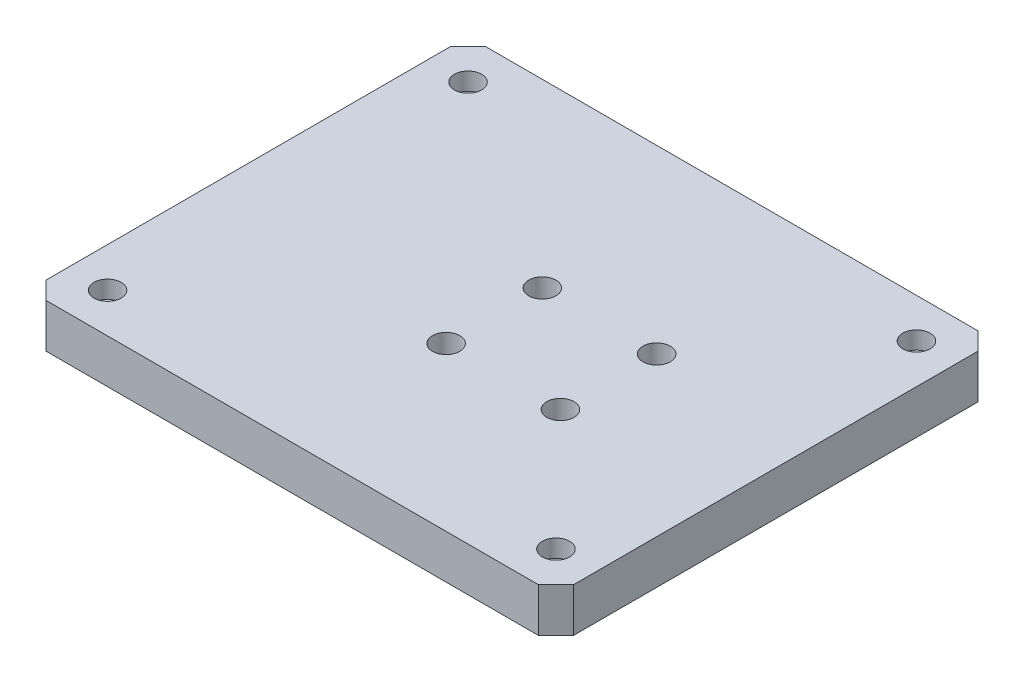
ISO-10303-21;
HEADER;
FILE_DESCRIPTION(('STEP AP214'),'2;1');
FILE_NAME('part.step','',(''),(''),'','','');
FILE_SCHEMA(('AUTOMOTIVE_DESIGN { 1 0 10303 214 1 1 1 1 }'));
ENDSEC;
DATA;
#1=APPLICATION_CONTEXT('core data for automotive mechanical design processes');
#2=APPLICATION_PROTOCOL_DEFINITION('international standard','automotive_design',2000,#1);
#3=PRODUCT_CONTEXT('',#1,'mechanical');
#4=PRODUCT('Part','Part','',(#3));
#5=PRODUCT_RELATED_PRODUCT_CATEGORY('part','',(#4));
#6=PRODUCT_DEFINITION_FORMATION('','',#4);
#7=PRODUCT_DEFINITION_CONTEXT('part definition',#1,'design');
#8=PRODUCT_DEFINITION('design','',#6,#7);
#9=PRODUCT_DEFINITION_SHAPE('','',#8);
#10=(LENGTH_UNIT() NAMED_UNIT(*) SI_UNIT(.MILLI.,.METRE.));
#11=(NAMED_UNIT(*) PLANE_ANGLE_UNIT() SI_UNIT($,.RADIAN.));
#12=(NAMED_UNIT(*) SI_UNIT($,.STERADIAN.) SOLID_ANGLE_UNIT());
#13=UNCERTAINTY_MEASURE_WITH_UNIT(LENGTH_MEASURE(1.E-05),#10,'distance_accuracy_value','');
#14=(GEOMETRIC_REPRESENTATION_CONTEXT(3) GLOBAL_UNCERTAINTY_ASSIGNED_CONTEXT((#13)) GLOBAL_UNIT_ASSIGNED_CONTEXT((#10,
#11,#12)) REPRESENTATION_CONTEXT('',''));
#15=CARTESIAN_POINT('',(0.,0.,0.));
#16=DIRECTION('',(0.,0.,1.));
#17=DIRECTION('',(1.,0.,0.));
#18=AXIS2_PLACEMENT_3D('',#15,#16,#17);
#19=CARTESIAN_POINT('',(0.,5.,0.));
#20=DIRECTION('',(1.,0.,0.));
#21=DIRECTION('',(0.,0.,-1.));
#22=AXIS2_PLACEMENT_3D('',#19,#20,#21);
#23=PLANE('',#22);
#24=DIRECTION('',(0.,0.,1.));
#25=VECTOR('',#24,1.);
#26=CARTESIAN_POINT('',(0.,0.,0.));
#27=LINE('',#26,#25);
#28=CARTESIAN_POINT('',(0.,0.,-48.));
#29=VERTEX_POINT('',#28);
#30=CARTESIAN_POINT('',(0.,0.,-2.00000000000002));
#31=VERTEX_POINT('',#30);
#32=EDGE_CURVE('E129',#29,#31,#27,.T.);
#33=ORIENTED_EDGE('',*,*,#32,.T.);
#34=DIRECTION('',(0.,1.,0.));
#35=VECTOR('',#34,1.);
#36=CARTESIAN_POINT('',(0.,5.,-2.00000000000002));
#37=LINE('',#36,#35);
#38=CARTESIAN_POINT('',(0.,5.,-2.00000000000002));
#39=VERTEX_POINT('',#38);
#40=EDGE_CURVE('E11',#31,#39,#37,.T.);
#41=ORIENTED_EDGE('',*,*,#40,.T.);
#42=DIRECTION('',(0.,0.,1.));
#43=VECTOR('',#42,1.);
#44=CARTESIAN_POINT('',(0.,5.,0.));
#45=LINE('',#44,#43);
#46=CARTESIAN_POINT('',(0.,5.,-48.));
#47=VERTEX_POINT('',#46);
#48=EDGE_CURVE('E127',#47,#39,#45,.T.);
#49=ORIENTED_EDGE('',*,*,#48,.F.);
#50=DIRECTION('',(0.,-1.,0.));
#51=VECTOR('',#50,1.);
#52=CARTESIAN_POINT('',(0.,5.,-48.));
#53=LINE('',#52,#51);
#54=EDGE_CURVE('E41',#47,#29,#53,.T.);
#55=ORIENTED_EDGE('',*,*,#54,.T.);
#56=EDGE_LOOP('',(#33,#41,#49,#55));
#57=FACE_BOUND('',#56,.T.);
#58=ADVANCED_FACE('F33',(#57),#23,.F.);
#59=CARTESIAN_POINT('',(0.,5.,0.));
#60=DIRECTION('',(0.,0.,-1.));
#61=DIRECTION('',(-1.,0.,0.));
#62=AXIS2_PLACEMENT_3D('',#59,#60,#61);
#63=PLANE('',#62);
#64=DIRECTION('',(1.,0.,0.));
#65=VECTOR('',#64,1.);
#66=CARTESIAN_POINT('',(0.,0.,0.));
#67=LINE('',#66,#65);
#68=CARTESIAN_POINT('',(2.00000000000001,0.,0.));
#69=VERTEX_POINT('',#68);
#70=CARTESIAN_POINT('',(58.,0.,0.));
#71=VERTEX_POINT('',#70);
#72=EDGE_CURVE('E125',#69,#71,#67,.T.);
#73=ORIENTED_EDGE('',*,*,#72,.T.);
#74=DIRECTION('',(0.,1.,0.));
#75=VECTOR('',#74,1.);
#76=CARTESIAN_POINT('',(58.,5.,0.));
#77=LINE('',#76,#75);
#78=CARTESIAN_POINT('',(58.,5.,0.));
#79=VERTEX_POINT('',#78);
#80=EDGE_CURVE('E104',#71,#79,#77,.T.);
#81=ORIENTED_EDGE('',*,*,#80,.T.);
#82=DIRECTION('',(1.,0.,0.));
#83=VECTOR('',#82,1.);
#84=CARTESIAN_POINT('',(0.,5.,0.));
#85=LINE('',#84,#83);
#86=CARTESIAN_POINT('',(2.00000000000001,5.,0.));
#87=VERTEX_POINT('',#86);
#88=EDGE_CURVE('E169',#87,#79,#85,.T.);
#89=ORIENTED_EDGE('',*,*,#88,.F.);
#90=DIRECTION('',(0.,-1.,0.));
#91=VECTOR('',#90,1.);
#92=CARTESIAN_POINT('',(2.00000000000001,5.,0.));
#93=LINE('',#92,#91);
#94=EDGE_CURVE('E109',#87,#69,#93,.T.);
#95=ORIENTED_EDGE('',*,*,#94,.T.);
#96=EDGE_LOOP('',(#73,#81,#89,#95));
#97=FACE_BOUND('',#96,.T.);
#98=ADVANCED_FACE('F242',(#97),#63,.F.);
#99=CARTESIAN_POINT('',(60.,5.,0.));
#100=DIRECTION('',(-1.,0.,0.));
#101=DIRECTION('',(0.,0.,1.));
#102=AXIS2_PLACEMENT_3D('',#99,#100,#101);
#103=PLANE('',#102);
#104=DIRECTION('',(0.,0.,-1.));
#105=VECTOR('',#104,1.);
#106=CARTESIAN_POINT('',(60.,5.,0.));
#107=LINE('',#106,#105);
#108=CARTESIAN_POINT('',(60.,5.,-2.00000000000001));
#109=VERTEX_POINT('',#108);
#110=CARTESIAN_POINT('',(60.,5.,-48.));
#111=VERTEX_POINT('',#110);
#112=EDGE_CURVE('E118',#109,#111,#107,.T.);
#113=ORIENTED_EDGE('',*,*,#112,.F.);
#114=DIRECTION('',(0.,-1.,0.));
#115=VECTOR('',#114,1.);
#116=CARTESIAN_POINT('',(60.,5.,-2.00000000000001));
#117=LINE('',#116,#115);
#118=CARTESIAN_POINT('',(60.,0.,-2.00000000000003));
#119=VERTEX_POINT('',#118);
#120=EDGE_CURVE('E103',#109,#119,#117,.T.);
#121=ORIENTED_EDGE('',*,*,#120,.T.);
#122=DIRECTION('',(0.,0.,-1.));
#123=VECTOR('',#122,1.);
#124=CARTESIAN_POINT('',(60.,0.,0.));
#125=LINE('',#124,#123);
#126=CARTESIAN_POINT('',(60.,0.,-48.));
#127=VERTEX_POINT('',#126);
#128=EDGE_CURVE('E116',#119,#127,#125,.T.);
#129=ORIENTED_EDGE('',*,*,#128,.T.);
#130=DIRECTION('',(0.,1.,0.));
#131=VECTOR('',#130,1.);
#132=CARTESIAN_POINT('',(60.,5.,-48.));
#133=LINE('',#132,#131);
#134=EDGE_CURVE('E120',#127,#111,#133,.T.);
#135=ORIENTED_EDGE('',*,*,#134,.T.);
#136=EDGE_LOOP('',(#113,#121,#129,#135));
#137=FACE_BOUND('',#136,.T.);
#138=ADVANCED_FACE('F115',(#137),#103,.F.);
#139=CARTESIAN_POINT('',(0.,5.,-50.));
#140=DIRECTION('',(0.,0.,1.));
#141=DIRECTION('',(1.,0.,0.));
#142=AXIS2_PLACEMENT_3D('',#139,#140,#141);
#143=PLANE('',#142);
#144=DIRECTION('',(-1.,0.,0.));
#145=VECTOR('',#144,1.);
#146=CARTESIAN_POINT('',(0.,5.,-50.));
#147=LINE('',#146,#145);
#148=CARTESIAN_POINT('',(58.,5.,-50.));
#149=VERTEX_POINT('',#148);
#150=CARTESIAN_POINT('',(2.00000000000002,5.,-50.));
#151=VERTEX_POINT('',#150);
#152=EDGE_CURVE('E133',#149,#151,#147,.T.);
#153=ORIENTED_EDGE('',*,*,#152,.F.);
#154=DIRECTION('',(0.,-1.,0.));
#155=VECTOR('',#154,1.);
#156=CARTESIAN_POINT('',(58.,5.,-50.));
#157=LINE('',#156,#155);
#158=CARTESIAN_POINT('',(58.,0.,-50.));
#159=VERTEX_POINT('',#158);
#160=EDGE_CURVE('E150',#149,#159,#157,.T.);
#161=ORIENTED_EDGE('',*,*,#160,.T.);
#162=DIRECTION('',(-1.,0.,0.));
#163=VECTOR('',#162,1.);
#164=CARTESIAN_POINT('',(0.,0.,-50.));
#165=LINE('',#164,#163);
#166=CARTESIAN_POINT('',(2.00000000000002,0.,-50.));
#167=VERTEX_POINT('',#166);
#168=EDGE_CURVE('E124',#159,#167,#165,.T.);
#169=ORIENTED_EDGE('',*,*,#168,.T.);
#170=DIRECTION('',(0.,1.,0.));
#171=VECTOR('',#170,1.);
#172=CARTESIAN_POINT('',(2.00000000000002,5.,-50.));
#173=LINE('',#172,#171);
#174=EDGE_CURVE('E48',#167,#151,#173,.T.);
#175=ORIENTED_EDGE('',*,*,#174,.T.);
#176=EDGE_LOOP('',(#153,#161,#169,#175));
#177=FACE_BOUND('',#176,.T.);
#178=ADVANCED_FACE('F223',(#177),#143,.F.);
#179=CARTESIAN_POINT('',(0.,5.,0.));
#180=DIRECTION('',(0.,-1.,0.));
#181=DIRECTION('',(0.,0.,-1.));
#182=AXIS2_PLACEMENT_3D('',#179,#180,#181);
#183=PLANE('',#182);
#184=CARTESIAN_POINT('',(29.,5.,-18.5090290205092));
#185=DIRECTION('',(0.,1.,0.));
#186=DIRECTION('',(0.,0.,1.));
#187=AXIS2_PLACEMENT_3D('',#184,#185,#186);
#188=CIRCLE('',#187,1.54999999999979);
#189=CARTESIAN_POINT('',(29.,5.,-16.9590290205094));
#190=VERTEX_POINT('',#189);
#191=EDGE_CURVE('E209',#190,#190,#188,.T.);
#192=ORIENTED_EDGE('',*,*,#191,.F.);
#193=EDGE_LOOP('',(#192));
#194=FACE_BOUND('',#193,.T.);
#195=CARTESIAN_POINT('',(42.,5.,-18.5090290205092));
#196=DIRECTION('',(0.,1.,0.));
#197=DIRECTION('',(0.,0.,1.));
#198=AXIS2_PLACEMENT_3D('',#195,#196,#197);
#199=CIRCLE('',#198,1.54999999999979);
#200=CARTESIAN_POINT('',(42.,5.,-16.9590290205094));
#201=VERTEX_POINT('',#200);
#202=EDGE_CURVE('E203',#201,#201,#199,.T.);
#203=ORIENTED_EDGE('',*,*,#202,.F.);
#204=EDGE_LOOP('',(#203));
#205=FACE_BOUND('',#204,.T.);
#206=CARTESIAN_POINT('',(29.,5.,-29.4460523784597));
#207=DIRECTION('',(0.,1.,0.));
#208=DIRECTION('',(0.,0.,1.));
#209=AXIS2_PLACEMENT_3D('',#206,#207,#208);
#210=CIRCLE('',#209,1.5499999999998);
#211=CARTESIAN_POINT('',(29.,5.,-27.8960523784599));
#212=VERTEX_POINT('',#211);
#213=EDGE_CURVE('E197',#212,#212,#210,.T.);
#214=ORIENTED_EDGE('',*,*,#213,.F.);
#215=EDGE_LOOP('',(#214));
#216=FACE_BOUND('',#215,.T.);
#217=CARTESIAN_POINT('',(42.,5.,-29.4460523784597));
#218=DIRECTION('',(0.,1.,0.));
#219=DIRECTION('',(0.,0.,1.));
#220=AXIS2_PLACEMENT_3D('',#217,#218,#219);
#221=CIRCLE('',#220,1.5499999999998);
#222=CARTESIAN_POINT('',(42.,5.,-27.8960523784599));
#223=VERTEX_POINT('',#222);
#224=EDGE_CURVE('E191',#223,#223,#221,.T.);
#225=ORIENTED_EDGE('',*,*,#224,.F.);
#226=EDGE_LOOP('',(#225));
#227=FACE_BOUND('',#226,.T.);
#228=CARTESIAN_POINT('',(55.5,5.,-45.5000000000095));
#229=DIRECTION('',(0.,1.,0.));
#230=DIRECTION('',(0.,0.,1.));
#231=AXIS2_PLACEMENT_3D('',#228,#229,#230);
#232=CIRCLE('',#231,1.54999999999724);
#233=CARTESIAN_POINT('',(55.5,5.,-43.9500000000123));
#234=VERTEX_POINT('',#233);
#235=EDGE_CURVE('E188',#234,#234,#232,.T.);
#236=ORIENTED_EDGE('',*,*,#235,.F.);
#237=EDGE_LOOP('',(#236));
#238=FACE_BOUND('',#237,.T.);
#239=CARTESIAN_POINT('',(4.50000000000003,5.,-45.5000000000095));
#240=DIRECTION('',(0.,1.,0.));
#241=DIRECTION('',(0.,0.,1.));
#242=AXIS2_PLACEMENT_3D('',#239,#240,#241);
#243=CIRCLE('',#242,1.54999999999724);
#244=CARTESIAN_POINT('',(4.50000000000003,5.,-43.9500000000123));
#245=VERTEX_POINT('',#244);
#246=EDGE_CURVE('E182',#245,#245,#243,.T.);
#247=ORIENTED_EDGE('',*,*,#246,.F.);
#248=EDGE_LOOP('',(#247));
#249=FACE_BOUND('',#248,.T.);
#250=CARTESIAN_POINT('',(4.50000000000002,5.,-4.5000000000095));
#251=DIRECTION('',(0.,1.,0.));
#252=DIRECTION('',(0.,0.,1.));
#253=AXIS2_PLACEMENT_3D('',#250,#251,#252);
#254=CIRCLE('',#253,1.54999999999725);
#255=CARTESIAN_POINT('',(4.50000000000002,5.,-2.95000000001225));
#256=VERTEX_POINT('',#255);
#257=EDGE_CURVE('E176',#256,#256,#254,.T.);
#258=ORIENTED_EDGE('',*,*,#257,.F.);
#259=EDGE_LOOP('',(#258));
#260=FACE_BOUND('',#259,.T.);
#261=CARTESIAN_POINT('',(55.5,5.,-4.50000000000949));
#262=DIRECTION('',(0.,1.,0.));
#263=DIRECTION('',(0.,0.,1.));
#264=AXIS2_PLACEMENT_3D('',#261,#262,#263);
#265=CIRCLE('',#264,1.54999999999725);
#266=CARTESIAN_POINT('',(55.5,5.,-2.95000000001224));
#267=VERTEX_POINT('',#266);
#268=EDGE_CURVE('E164',#267,#267,#265,.T.);
#269=ORIENTED_EDGE('',*,*,#268,.F.);
#270=EDGE_LOOP('',(#269));
#271=FACE_BOUND('',#270,.T.);
#272=ORIENTED_EDGE('',*,*,#88,.T.);
#273=DIRECTION('',(-0.707106781186549,0.,0.707106781186546));
#274=VECTOR('',#273,1.);
#275=CARTESIAN_POINT('',(60.,5.,-2.00000000000001));
#276=LINE('',#275,#274);
#277=EDGE_CURVE('E147',#79,#109,#276,.F.);
#278=ORIENTED_EDGE('',*,*,#277,.T.);
#279=ORIENTED_EDGE('',*,*,#112,.T.);
#280=DIRECTION('',(0.707106781186546,0.,0.707106781186549));
#281=VECTOR('',#280,1.);
#282=CARTESIAN_POINT('',(58.,5.,-50.));
#283=LINE('',#282,#281);
#284=EDGE_CURVE('E55',#111,#149,#283,.F.);
#285=ORIENTED_EDGE('',*,*,#284,.T.);
#286=ORIENTED_EDGE('',*,*,#152,.T.);
#287=DIRECTION('',(0.707106781186549,0.,-0.707106781186546));
#288=VECTOR('',#287,1.);
#289=CARTESIAN_POINT('',(0.,5.,-48.));
#290=LINE('',#289,#288);
#291=EDGE_CURVE('E142',#151,#47,#290,.F.);
#292=ORIENTED_EDGE('',*,*,#291,.T.);
#293=ORIENTED_EDGE('',*,*,#48,.T.);
#294=DIRECTION('',(-0.707106781186546,0.,-0.707106781186549));
#295=VECTOR('',#294,1.);
#296=CARTESIAN_POINT('',(2.00000000000001,5.,0.));
#297=LINE('',#296,#295);
#298=EDGE_CURVE('E144',#39,#87,#297,.F.);
#299=ORIENTED_EDGE('',*,*,#298,.T.);
#300=EDGE_LOOP('',(#272,#278,#279,#285,#286,#292,#293,#299));
#301=FACE_BOUND('',#300,.T.);
#302=ADVANCED_FACE('F220',(#194,#205,#216,#227,#238,#249,#260,#271,#301),#183,.F.);
#303=CARTESIAN_POINT('',(0.,0.,0.));
#304=DIRECTION('',(0.,-1.,0.));
#305=DIRECTION('',(0.,0.,-1.));
#306=AXIS2_PLACEMENT_3D('',#303,#304,#305);
#307=PLANE('',#306);
#308=CARTESIAN_POINT('',(29.,0.,-18.5090290205092));
#309=DIRECTION('',(0.,-1.,0.));
#310=DIRECTION('',(0.,0.,-1.));
#311=AXIS2_PLACEMENT_3D('',#308,#309,#310);
#312=CIRCLE('',#311,1.54999999999979);
#313=CARTESIAN_POINT('',(29.,0.,-20.059029020509));
#314=VERTEX_POINT('',#313);
#315=EDGE_CURVE('E212',#314,#314,#312,.F.);
#316=ORIENTED_EDGE('',*,*,#315,.T.);
#317=EDGE_LOOP('',(#316));
#318=FACE_BOUND('',#317,.T.);
#319=CARTESIAN_POINT('',(42.,0.,-18.5090290205092));
#320=DIRECTION('',(0.,-1.,0.));
#321=DIRECTION('',(0.,0.,-1.));
#322=AXIS2_PLACEMENT_3D('',#319,#320,#321);
#323=CIRCLE('',#322,1.54999999999979);
#324=CARTESIAN_POINT('',(42.,0.,-20.059029020509));
#325=VERTEX_POINT('',#324);
#326=EDGE_CURVE('E206',#325,#325,#323,.F.);
#327=ORIENTED_EDGE('',*,*,#326,.T.);
#328=EDGE_LOOP('',(#327));
#329=FACE_BOUND('',#328,.T.);
#330=CARTESIAN_POINT('',(29.,0.,-29.4460523784597));
#331=DIRECTION('',(0.,-1.,0.));
#332=DIRECTION('',(0.,0.,-1.));
#333=AXIS2_PLACEMENT_3D('',#330,#331,#332);
#334=CIRCLE('',#333,1.5499999999998);
#335=CARTESIAN_POINT('',(29.,0.,-30.9960523784594));
#336=VERTEX_POINT('',#335);
#337=EDGE_CURVE('E200',#336,#336,#334,.F.);
#338=ORIENTED_EDGE('',*,*,#337,.T.);
#339=EDGE_LOOP('',(#338));
#340=FACE_BOUND('',#339,.T.);
#341=CARTESIAN_POINT('',(42.,0.,-29.4460523784597));
#342=DIRECTION('',(0.,-1.,0.));
#343=DIRECTION('',(0.,0.,-1.));
#344=AXIS2_PLACEMENT_3D('',#341,#342,#343);
#345=CIRCLE('',#344,1.5499999999998);
#346=CARTESIAN_POINT('',(42.,0.,-30.9960523784595));
#347=VERTEX_POINT('',#346);
#348=EDGE_CURVE('E194',#347,#347,#345,.F.);
#349=ORIENTED_EDGE('',*,*,#348,.T.);
#350=EDGE_LOOP('',(#349));
#351=FACE_BOUND('',#350,.T.);
#352=ORIENTED_EDGE('',*,*,#128,.F.);
#353=DIRECTION('',(0.707106781186549,0.,-0.707106781186546));
#354=VECTOR('',#353,1.);
#355=CARTESIAN_POINT('',(28.9999999999999,0.,29.));
#356=LINE('',#355,#354);
#357=EDGE_CURVE('E99',#119,#71,#356,.F.);
#358=ORIENTED_EDGE('',*,*,#357,.T.);
#359=ORIENTED_EDGE('',*,*,#72,.F.);
#360=DIRECTION('',(0.707106781186546,0.,0.707106781186549));
#361=VECTOR('',#360,1.);
#362=CARTESIAN_POINT('',(1.00000000000001,0.,-1.));
#363=LINE('',#362,#361);
#364=EDGE_CURVE('E136',#69,#31,#363,.F.);
#365=ORIENTED_EDGE('',*,*,#364,.T.);
#366=ORIENTED_EDGE('',*,*,#32,.F.);
#367=DIRECTION('',(-0.707106781186549,0.,0.707106781186546));
#368=VECTOR('',#367,1.);
#369=CARTESIAN_POINT('',(-24.,0.,-24.0000000000001));
#370=LINE('',#369,#368);
#371=EDGE_CURVE('E119',#29,#167,#370,.F.);
#372=ORIENTED_EDGE('',*,*,#371,.T.);
#373=ORIENTED_EDGE('',*,*,#168,.F.);
#374=DIRECTION('',(-0.707106781186546,0.,-0.707106781186549));
#375=VECTOR('',#374,1.);
#376=CARTESIAN_POINT('',(54.0000000000001,0.,-53.9999999999999));
#377=LINE('',#376,#375);
#378=EDGE_CURVE('E110',#159,#127,#377,.F.);
#379=ORIENTED_EDGE('',*,*,#378,.T.);
#380=EDGE_LOOP('',(#352,#358,#359,#365,#366,#372,#373,#379));
#381=FACE_BOUND('',#380,.T.);
#382=ADVANCED_FACE('F122',(#318,#329,#340,#351,#381),#307,.T.);
#383=CARTESIAN_POINT('',(60.,5.,-2.00000000000001));
#384=DIRECTION('',(-0.707106781186546,0.,-0.707106781186549));
#385=DIRECTION('',(0.,-1.,0.));
#386=AXIS2_PLACEMENT_3D('',#383,#384,#385);
#387=PLANE('',#386);
#388=ORIENTED_EDGE('',*,*,#277,.F.);
#389=ORIENTED_EDGE('',*,*,#80,.F.);
#390=ORIENTED_EDGE('',*,*,#357,.F.);
#391=ORIENTED_EDGE('',*,*,#120,.F.);
#392=EDGE_LOOP('',(#388,#389,#390,#391));
#393=FACE_BOUND('',#392,.T.);
#394=ADVANCED_FACE('F102',(#393),#387,.F.);
#395=CARTESIAN_POINT('',(58.,5.,-50.));
#396=DIRECTION('',(-0.707106781186549,0.,0.707106781186546));
#397=DIRECTION('',(0.,-1.,0.));
#398=AXIS2_PLACEMENT_3D('',#395,#396,#397);
#399=PLANE('',#398);
#400=ORIENTED_EDGE('',*,*,#284,.F.);
#401=ORIENTED_EDGE('',*,*,#134,.F.);
#402=ORIENTED_EDGE('',*,*,#378,.F.);
#403=ORIENTED_EDGE('',*,*,#160,.F.);
#404=EDGE_LOOP('',(#400,#401,#402,#403));
#405=FACE_BOUND('',#404,.T.);
#406=ADVANCED_FACE('F254',(#405),#399,.F.);
#407=CARTESIAN_POINT('',(2.00000000000001,5.,0.));
#408=DIRECTION('',(0.707106781186549,0.,-0.707106781186546));
#409=DIRECTION('',(0.,-1.,0.));
#410=AXIS2_PLACEMENT_3D('',#407,#408,#409);
#411=PLANE('',#410);
#412=ORIENTED_EDGE('',*,*,#298,.F.);
#413=ORIENTED_EDGE('',*,*,#40,.F.);
#414=ORIENTED_EDGE('',*,*,#364,.F.);
#415=ORIENTED_EDGE('',*,*,#94,.F.);
#416=EDGE_LOOP('',(#412,#413,#414,#415));
#417=FACE_BOUND('',#416,.T.);
#418=ADVANCED_FACE('F244',(#417),#411,.F.);
#419=CARTESIAN_POINT('',(0.,5.,-48.));
#420=DIRECTION('',(0.707106781186546,0.,0.707106781186549));
#421=DIRECTION('',(0.,-1.,0.));
#422=AXIS2_PLACEMENT_3D('',#419,#420,#421);
#423=PLANE('',#422);
#424=ORIENTED_EDGE('',*,*,#291,.F.);
#425=ORIENTED_EDGE('',*,*,#174,.F.);
#426=ORIENTED_EDGE('',*,*,#371,.F.);
#427=ORIENTED_EDGE('',*,*,#54,.F.);
#428=EDGE_LOOP('',(#424,#425,#426,#427));
#429=FACE_BOUND('',#428,.T.);
#430=ADVANCED_FACE('F35',(#429),#423,.F.);
#431=CARTESIAN_POINT('',(55.5,3.,-4.50000000000949));
#432=DIRECTION('',(0.,1.,0.));
#433=DIRECTION('',(0.,0.,1.));
#434=AXIS2_PLACEMENT_3D('',#431,#432,#433);
#435=CYLINDRICAL_SURFACE('',#434,1.54999999999725);
#436=CARTESIAN_POINT('',(55.5,3.,-4.50000000000949));
#437=DIRECTION('',(0.,1.,0.));
#438=DIRECTION('',(0.,0.,1.));
#439=AXIS2_PLACEMENT_3D('',#436,#437,#438);
#440=CIRCLE('',#439,1.54999999999725);
#441=CARTESIAN_POINT('',(55.5,3.,-2.95000000001224));
#442=VERTEX_POINT('',#441);
#443=EDGE_CURVE('E162',#442,#442,#440,.T.);
#444=ORIENTED_EDGE('',*,*,#443,.F.);
#445=EDGE_LOOP('',(#444));
#446=FACE_BOUND('',#445,.T.);
#447=ORIENTED_EDGE('',*,*,#268,.T.);
#448=EDGE_LOOP('',(#447));
#449=FACE_BOUND('',#448,.T.);
#450=ADVANCED_FACE('F246',(#446,#449),#435,.F.);
#451=CARTESIAN_POINT('',(55.5,3.,-4.50000000000949));
#452=DIRECTION('',(0.,1.,0.));
#453=DIRECTION('',(0.,0.,1.));
#454=AXIS2_PLACEMENT_3D('',#451,#452,#453);
#455=PLANE('',#454);
#456=ORIENTED_EDGE('',*,*,#443,.T.);
#457=EDGE_LOOP('',(#456));
#458=FACE_BOUND('',#457,.T.);
#459=ADVANCED_FACE('F251',(#458),#455,.T.);
#460=CARTESIAN_POINT('',(4.50000000000002,3.,-4.5000000000095));
#461=DIRECTION('',(0.,1.,0.));
#462=DIRECTION('',(0.,0.,1.));
#463=AXIS2_PLACEMENT_3D('',#460,#461,#462);
#464=CYLINDRICAL_SURFACE('',#463,1.54999999999725);
#465=CARTESIAN_POINT('',(4.50000000000002,3.,-4.5000000000095));
#466=DIRECTION('',(0.,1.,0.));
#467=DIRECTION('',(0.,0.,1.));
#468=AXIS2_PLACEMENT_3D('',#465,#466,#467);
#469=CIRCLE('',#468,1.54999999999725);
#470=CARTESIAN_POINT('',(4.50000000000002,3.,-2.95000000001225));
#471=VERTEX_POINT('',#470);
#472=EDGE_CURVE('E174',#471,#471,#469,.T.);
#473=ORIENTED_EDGE('',*,*,#472,.F.);
#474=EDGE_LOOP('',(#473));
#475=FACE_BOUND('',#474,.T.);
#476=ORIENTED_EDGE('',*,*,#257,.T.);
#477=EDGE_LOOP('',(#476));
#478=FACE_BOUND('',#477,.T.);
#479=ADVANCED_FACE('F282',(#475,#478),#464,.F.);
#480=CARTESIAN_POINT('',(4.50000000000002,3.,-4.5000000000095));
#481=DIRECTION('',(0.,1.,0.));
#482=DIRECTION('',(0.,0.,1.));
#483=AXIS2_PLACEMENT_3D('',#480,#481,#482);
#484=PLANE('',#483);
#485=ORIENTED_EDGE('',*,*,#472,.T.);
#486=EDGE_LOOP('',(#485));
#487=FACE_BOUND('',#486,.T.);
#488=ADVANCED_FACE('F286',(#487),#484,.T.);
#489=CARTESIAN_POINT('',(4.50000000000003,3.,-45.5000000000095));
#490=DIRECTION('',(0.,1.,0.));
#491=DIRECTION('',(0.,0.,1.));
#492=AXIS2_PLACEMENT_3D('',#489,#490,#491);
#493=CYLINDRICAL_SURFACE('',#492,1.54999999999724);
#494=CARTESIAN_POINT('',(4.50000000000003,3.,-45.5000000000095));
#495=DIRECTION('',(0.,1.,0.));
#496=DIRECTION('',(0.,0.,1.));
#497=AXIS2_PLACEMENT_3D('',#494,#495,#496);
#498=CIRCLE('',#497,1.54999999999724);
#499=CARTESIAN_POINT('',(4.50000000000003,3.,-43.9500000000123));
#500=VERTEX_POINT('',#499);
#501=EDGE_CURVE('E179',#500,#500,#498,.T.);
#502=ORIENTED_EDGE('',*,*,#501,.F.);
#503=EDGE_LOOP('',(#502));
#504=FACE_BOUND('',#503,.T.);
#505=ORIENTED_EDGE('',*,*,#246,.T.);
#506=EDGE_LOOP('',(#505));
#507=FACE_BOUND('',#506,.T.);
#508=ADVANCED_FACE('F290',(#504,#507),#493,.F.);
#509=CARTESIAN_POINT('',(4.50000000000003,3.,-45.5000000000095));
#510=DIRECTION('',(0.,1.,0.));
#511=DIRECTION('',(0.,0.,1.));
#512=AXIS2_PLACEMENT_3D('',#509,#510,#511);
#513=PLANE('',#512);
#514=ORIENTED_EDGE('',*,*,#501,.T.);
#515=EDGE_LOOP('',(#514));
#516=FACE_BOUND('',#515,.T.);
#517=ADVANCED_FACE('F294',(#516),#513,.T.);
#518=CARTESIAN_POINT('',(55.5,3.,-45.5000000000095));
#519=DIRECTION('',(0.,1.,0.));
#520=DIRECTION('',(0.,0.,1.));
#521=AXIS2_PLACEMENT_3D('',#518,#519,#520);
#522=CYLINDRICAL_SURFACE('',#521,1.54999999999724);
#523=CARTESIAN_POINT('',(55.5,3.,-45.5000000000095));
#524=DIRECTION('',(0.,1.,0.));
#525=DIRECTION('',(0.,0.,1.));
#526=AXIS2_PLACEMENT_3D('',#523,#524,#525);
#527=CIRCLE('',#526,1.54999999999724);
#528=CARTESIAN_POINT('',(55.5,3.,-43.9500000000123));
#529=VERTEX_POINT('',#528);
#530=EDGE_CURVE('E185',#529,#529,#527,.T.);
#531=ORIENTED_EDGE('',*,*,#530,.F.);
#532=EDGE_LOOP('',(#531));
#533=FACE_BOUND('',#532,.T.);
#534=ORIENTED_EDGE('',*,*,#235,.T.);
#535=EDGE_LOOP('',(#534));
#536=FACE_BOUND('',#535,.T.);
#537=ADVANCED_FACE('F298',(#533,#536),#522,.F.);
#538=CARTESIAN_POINT('',(55.5,3.,-45.5000000000095));
#539=DIRECTION('',(0.,1.,0.));
#540=DIRECTION('',(0.,0.,1.));
#541=AXIS2_PLACEMENT_3D('',#538,#539,#540);
#542=PLANE('',#541);
#543=ORIENTED_EDGE('',*,*,#530,.T.);
#544=EDGE_LOOP('',(#543));
#545=FACE_BOUND('',#544,.T.);
#546=ADVANCED_FACE('F302',(#545),#542,.T.);
#547=CARTESIAN_POINT('',(42.,-0.00100000000000013,-29.4460523784597));
#548=DIRECTION('',(0.,1.,0.));
#549=DIRECTION('',(0.,0.,1.));
#550=AXIS2_PLACEMENT_3D('',#547,#548,#549);
#551=CYLINDRICAL_SURFACE('',#550,1.5499999999998);
#552=ORIENTED_EDGE('',*,*,#348,.F.);
#553=EDGE_LOOP('',(#552));
#554=FACE_BOUND('',#553,.T.);
#555=ORIENTED_EDGE('',*,*,#224,.T.);
#556=EDGE_LOOP('',(#555));
#557=FACE_BOUND('',#556,.T.);
#558=ADVANCED_FACE('F306',(#554,#557),#551,.F.);
#559=CARTESIAN_POINT('',(29.,-0.00100000000000013,-29.4460523784597));
#560=DIRECTION('',(0.,1.,0.));
#561=DIRECTION('',(0.,0.,1.));
#562=AXIS2_PLACEMENT_3D('',#559,#560,#561);
#563=CYLINDRICAL_SURFACE('',#562,1.5499999999998);
#564=ORIENTED_EDGE('',*,*,#337,.F.);
#565=EDGE_LOOP('',(#564));
#566=FACE_BOUND('',#565,.T.);
#567=ORIENTED_EDGE('',*,*,#213,.T.);
#568=EDGE_LOOP('',(#567));
#569=FACE_BOUND('',#568,.T.);
#570=ADVANCED_FACE('F310',(#566,#569),#563,.F.);
#571=CARTESIAN_POINT('',(42.,-0.00100000000000013,-18.5090290205092));
#572=DIRECTION('',(0.,1.,0.));
#573=DIRECTION('',(0.,0.,1.));
#574=AXIS2_PLACEMENT_3D('',#571,#572,#573);
#575=CYLINDRICAL_SURFACE('',#574,1.54999999999979);
#576=ORIENTED_EDGE('',*,*,#326,.F.);
#577=EDGE_LOOP('',(#576));
#578=FACE_BOUND('',#577,.T.);
#579=ORIENTED_EDGE('',*,*,#202,.T.);
#580=EDGE_LOOP('',(#579));
#581=FACE_BOUND('',#580,.T.);
#582=ADVANCED_FACE('F314',(#578,#581),#575,.F.);
#583=CARTESIAN_POINT('',(29.,-0.00100000000000013,-18.5090290205092));
#584=DIRECTION('',(0.,1.,0.));
#585=DIRECTION('',(0.,0.,1.));
#586=AXIS2_PLACEMENT_3D('',#583,#584,#585);
#587=CYLINDRICAL_SURFACE('',#586,1.54999999999979);
#588=ORIENTED_EDGE('',*,*,#315,.F.);
#589=EDGE_LOOP('',(#588));
#590=FACE_BOUND('',#589,.T.);
#591=ORIENTED_EDGE('',*,*,#191,.T.);
#592=EDGE_LOOP('',(#591));
#593=FACE_BOUND('',#592,.T.);
#594=ADVANCED_FACE('F218',(#590,#593),#587,.F.);
#595=CLOSED_SHELL('',(#58,#98,#138,#178,#302,#382,#394,#406,#418,#430,#450,#459,#479,#488,#508,
#517,#537,#546,#558,#570,#582,#594));
#596=MANIFOLD_SOLID_BREP('B2',#595);
#597=ADVANCED_BREP_SHAPE_REPRESENTATION('',(#18,#596),#14);
#598=SHAPE_DEFINITION_REPRESENTATION(#9,#597);
ENDSEC;
END-ISO-10303-21;
